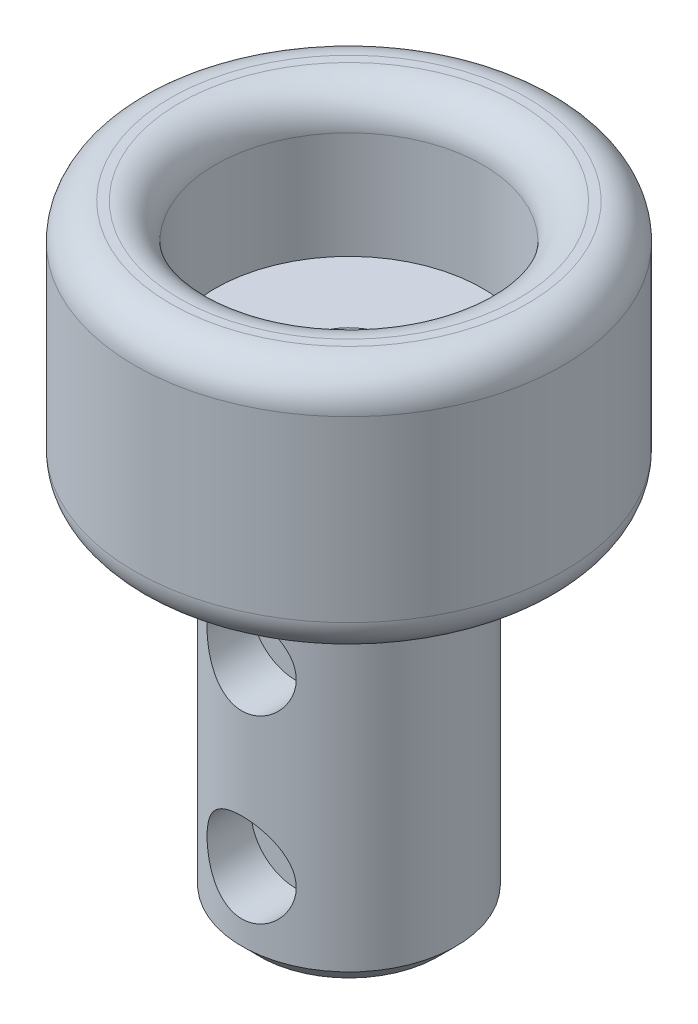
ISO-10303-21;
HEADER;
FILE_DESCRIPTION(('STEP AP214'),'2;1');
FILE_NAME('part.step','',(''),(''),'','','');
FILE_SCHEMA(('AUTOMOTIVE_DESIGN { 1 0 10303 214 1 1 1 1 }'));
ENDSEC;
DATA;
#1=APPLICATION_CONTEXT('core data for automotive mechanical design processes');
#2=APPLICATION_PROTOCOL_DEFINITION('international standard','automotive_design',2000,#1);
#3=PRODUCT_CONTEXT('',#1,'mechanical');
#4=PRODUCT('Part','Part','',(#3));
#5=PRODUCT_RELATED_PRODUCT_CATEGORY('part','',(#4));
#6=PRODUCT_DEFINITION_FORMATION('','',#4);
#7=PRODUCT_DEFINITION_CONTEXT('part definition',#1,'design');
#8=PRODUCT_DEFINITION('design','',#6,#7);
#9=PRODUCT_DEFINITION_SHAPE('','',#8);
#10=(LENGTH_UNIT() NAMED_UNIT(*) SI_UNIT(.MILLI.,.METRE.));
#11=(NAMED_UNIT(*) PLANE_ANGLE_UNIT() SI_UNIT($,.RADIAN.));
#12=(NAMED_UNIT(*) SI_UNIT($,.STERADIAN.) SOLID_ANGLE_UNIT());
#13=UNCERTAINTY_MEASURE_WITH_UNIT(LENGTH_MEASURE(1.E-05),#10,'distance_accuracy_value','');
#14=(GEOMETRIC_REPRESENTATION_CONTEXT(3) GLOBAL_UNCERTAINTY_ASSIGNED_CONTEXT((#13)) GLOBAL_UNIT_ASSIGNED_CONTEXT((#10,
#11,#12)) REPRESENTATION_CONTEXT('',''));
#15=CARTESIAN_POINT('',(0.,0.,0.));
#16=DIRECTION('',(0.,0.,1.));
#17=DIRECTION('',(1.,0.,0.));
#18=AXIS2_PLACEMENT_3D('',#15,#16,#17);
#19=CARTESIAN_POINT('',(0.,-10.1,0.));
#20=DIRECTION('',(0.,1.,0.));
#21=DIRECTION('',(0.,0.,1.));
#22=AXIS2_PLACEMENT_3D('',#19,#20,#21);
#23=CYLINDRICAL_SURFACE('',#22,3.);
#24=CARTESIAN_POINT('',(0.,-0.6,0.));
#25=DIRECTION('',(0.,-1.,0.));
#26=DIRECTION('',(0.,0.,-1.));
#27=AXIS2_PLACEMENT_3D('',#24,#25,#26);
#28=CIRCLE('',#27,3.);
#29=CARTESIAN_POINT('',(0.,-0.6,-3.));
#30=VERTEX_POINT('',#29);
#31=EDGE_CURVE('E53',#30,#30,#28,.T.);
#32=ORIENTED_EDGE('',*,*,#31,.T.);
#33=EDGE_LOOP('',(#32));
#34=FACE_BOUND('',#33,.T.);
#35=CARTESIAN_POINT('',(0.,-9.6,0.));
#36=DIRECTION('',(0.,-1.,0.));
#37=DIRECTION('',(0.,0.,-1.));
#38=AXIS2_PLACEMENT_3D('',#35,#36,#37);
#39=CIRCLE('',#38,3.);
#40=CARTESIAN_POINT('',(0.,-9.6,-3.));
#41=VERTEX_POINT('',#40);
#42=EDGE_CURVE('E57',#41,#41,#39,.F.);
#43=ORIENTED_EDGE('',*,*,#42,.T.);
#44=EDGE_LOOP('',(#43));
#45=FACE_BOUND('',#44,.T.);
#46=CARTESIAN_POINT('',(0.,-3.88538633236561,3.));
#47=CARTESIAN_POINT('',(0.066958052636267,-3.88537912727431,2.99999458367273));
#48=CARTESIAN_POINT('',(0.134021397063841,-3.87997437383747,2.9977323297471));
#49=CARTESIAN_POINT('',(0.266247371156347,-3.85854726744543,2.98890153579552));
#50=CARTESIAN_POINT('',(0.331404576423565,-3.84249720790136,2.98232175901028));
#51=CARTESIAN_POINT('',(0.457688733653088,-3.80047524058502,2.96556289038127));
#52=CARTESIAN_POINT('',(0.518828524426269,-3.77453694289746,2.95539599975004));
#53=CARTESIAN_POINT('',(0.635829756679803,-3.71361350913304,2.93245286470664));
#54=CARTESIAN_POINT('',(0.69169279001594,-3.67863111339474,2.91967741092849));
#55=CARTESIAN_POINT('',(0.799448403559513,-3.59875734977473,2.89207828351869));
#56=CARTESIAN_POINT('',(0.85104126751777,-3.55348502357586,2.87718753326093));
#57=CARTESIAN_POINT('',(0.946159821091264,-3.45512199758304,2.84732714068514));
#58=CARTESIAN_POINT('',(0.989681263153087,-3.4020272074711,2.83235746106809));
#59=CARTESIAN_POINT('',(1.06953737697066,-3.28635955480071,2.80321021812995));
#60=CARTESIAN_POINT('',(1.10541308153925,-3.22344888393906,2.78910786873385));
#61=CARTESIAN_POINT('',(1.16593940588866,-3.09181307444468,2.76435572357005));
#62=CARTESIAN_POINT('',(1.19059580836291,-3.02309095288116,2.75370415000823));
#63=CARTESIAN_POINT('',(1.22674598312159,-2.88523264059769,2.73778555387705));
#64=CARTESIAN_POINT('',(1.23881657877606,-2.81627584897345,2.73228387651787));
#65=CARTESIAN_POINT('',(1.25125209967796,-2.67711303967904,2.72661326219504));
#66=CARTESIAN_POINT('',(1.25162348054397,-2.60690773233987,2.7264413842526));
#67=CARTESIAN_POINT('',(1.24108450363674,-2.47298627193067,2.73125119560853));
#68=CARTESIAN_POINT('',(1.23103681112301,-2.40918523580115,2.73583882723623));
#69=CARTESIAN_POINT('',(1.20139191015777,-2.28427424136522,2.74898482773796));
#70=CARTESIAN_POINT('',(1.18179287287177,-2.22316480087383,2.75754395703564));
#71=CARTESIAN_POINT('',(1.13321958727571,-2.10382862937416,2.77786184772756));
#72=CARTESIAN_POINT('',(1.10405471539236,-2.04569091145223,2.78968481949136));
#73=CARTESIAN_POINT('',(1.03731242580562,-1.93490859848546,2.81518331141086));
#74=CARTESIAN_POINT('',(0.999731690519546,-1.88226618175209,2.82885956129779));
#75=CARTESIAN_POINT('',(0.913495965543837,-1.77928637363277,2.85792976877979));
#76=CARTESIAN_POINT('',(0.864173483207528,-1.72951976498017,2.87337121404473));
#77=CARTESIAN_POINT('',(0.757729591051514,-1.63877282940642,2.90325673112529));
#78=CARTESIAN_POINT('',(0.700606359448458,-1.59779456067343,2.9177005687701));
#79=CARTESIAN_POINT('',(0.578447948693378,-1.52495050874934,2.94438283556473));
#80=CARTESIAN_POINT('',(0.513260582447682,-1.49331688721492,2.95656266543334));
#81=CARTESIAN_POINT('',(0.377852402526833,-1.44166519276235,2.97689481414803));
#82=CARTESIAN_POINT('',(0.307634394795036,-1.42164070042179,2.985049358458));
#83=CARTESIAN_POINT('',(0.168928113346229,-1.39497034023897,2.99599641186385));
#84=CARTESIAN_POINT('',(0.10061128527864,-1.38755847492186,2.99909541047125));
#85=CARTESIAN_POINT('',(-0.0363546554960888,-1.38404010875151,3.00056050368745));
#86=CARTESIAN_POINT('',(-0.105003667152635,-1.38793036211361,2.99892795711939));
#87=CARTESIAN_POINT('',(-0.237098242341435,-1.40635741717167,2.9913121765694));
#88=CARTESIAN_POINT('',(-0.300632966639386,-1.4203562864628,2.9855488728399));
#89=CARTESIAN_POINT('',(-0.424382748971091,-1.45785452690639,2.97048606772414));
#90=CARTESIAN_POINT('',(-0.484597386518361,-1.48135509831591,2.96118611959704));
#91=CARTESIAN_POINT('',(-0.602108999869136,-1.53795730807772,2.93958270645166));
#92=CARTESIAN_POINT('',(-0.659257236855324,-1.57133451551164,2.92719491469281));
#93=CARTESIAN_POINT('',(-0.767346216231429,-1.6464397101573,2.9007380457909));
#94=CARTESIAN_POINT('',(-0.818284352601941,-1.68817118389488,2.88666826768733));
#95=CARTESIAN_POINT('',(-0.916333430274264,-1.78228956563801,2.85712087895438));
#96=CARTESIAN_POINT('',(-0.962910697979836,-1.83522483535187,2.84161451591029));
#97=CARTESIAN_POINT('',(-1.04666984610551,-1.948407608301,2.81184336768005));
#98=CARTESIAN_POINT('',(-1.08384959285617,-2.00865676753734,2.79757886493438));
#99=CARTESIAN_POINT('',(-1.14815960208699,-2.13600050766818,2.77181386243988));
#100=CARTESIAN_POINT('',(-1.17513918237329,-2.20318036788044,2.76035562555112));
#101=CARTESIAN_POINT('',(-1.21717413951573,-2.34175692617571,2.74208355658957));
#102=CARTESIAN_POINT('',(-1.23223934863688,-2.41315009484895,2.73526589555752));
#103=CARTESIAN_POINT('',(-1.24904080348901,-2.55220503156482,2.72763164537264));
#104=CARTESIAN_POINT('',(-1.25171380413129,-2.61973099465822,2.72639350967163));
#105=CARTESIAN_POINT('',(-1.24615575523912,-2.75422919350671,2.72893853011024));
#106=CARTESIAN_POINT('',(-1.23792637964722,-2.8212015126793,2.73272091540306));
#107=CARTESIAN_POINT('',(-1.21158404780491,-2.9494790798345,2.74449551302268));
#108=CARTESIAN_POINT('',(-1.19394903571466,-3.010903005829,2.7522835484648));
#109=CARTESIAN_POINT('',(-1.14976328202135,-3.12993435372283,2.77103181199189));
#110=CARTESIAN_POINT('',(-1.12321003517252,-3.18754069776439,2.78199293131693));
#111=CARTESIAN_POINT('',(-1.0601028593549,-3.30108222831473,2.80666954560013));
#112=CARTESIAN_POINT('',(-1.02304360910483,-3.3567086625339,2.82051102713679));
#113=CARTESIAN_POINT('',(-0.940684072630393,-3.46124647172629,2.84903689053839));
#114=CARTESIAN_POINT('',(-0.895380928905621,-3.51015550796618,2.86372156345875));
#115=CARTESIAN_POINT('',(-0.793902045778823,-3.60353501405035,2.89356392850106));
#116=CARTESIAN_POINT('',(-0.73717473994903,-3.64742276520626,2.90867817511792));
#117=CARTESIAN_POINT('',(-0.616600079253201,-3.72508578590923,2.9366014362202));
#118=CARTESIAN_POINT('',(-0.552749497945747,-3.75885644725516,2.9494093991674));
#119=CARTESIAN_POINT('',(-0.420732056717951,-3.81459617780549,2.97109183362461));
#120=CARTESIAN_POINT('',(-0.352653990980637,-3.83675109898291,2.98002782581964));
#121=CARTESIAN_POINT('',(-0.213410421846559,-3.86909266144344,2.99321009768625));
#122=CARTESIAN_POINT('',(-0.142255316980958,-3.87931677489549,2.99747105811967));
#123=CARTESIAN_POINT('',(-0.0472360819191837,-3.88471949345206,2.99972287568934));
#124=CARTESIAN_POINT('',(-0.0236245946756573,-3.88538887451483,3.00000191102536));
#125=CARTESIAN_POINT('',(0.,-3.88538633236561,3.));
#126=B_SPLINE_CURVE_WITH_KNOTS('',3,(#46,#47,#48,#49,#50,#51,#52,#53,#54,#55,#56,#57,#58,#59,
#60,#61,#62,#63,#64,#65,#66,#67,#68,#69,#70,#71,#72,#73,#74,#75,#76,#77,#78,#79,#80,#81,#82,#83,
#84,#85,#86,#87,#88,#89,#90,#91,#92,#93,#94,#95,#96,#97,#98,#99,#100,#101,#102,#103,#104,#105,
#106,#107,#108,#109,#110,#111,#112,#113,#114,#115,#116,#117,#118,#119,#120,#121,#122,#123,#124,
#125),.UNSPECIFIED.,.T.,.F.,(4,2,2,2,2,2,2,2,2,2,2,2,2,2,2,2,2,2,2,2,2,2,2,2,2,2,2,2,2,2,2,2,2,
2,2,2,2,2,2,4),(0.,0.200806918883939,0.402138540628697,0.602791851906302,0.803384436852976,
1.01317936288807,1.22308438131466,1.44331724539125,1.66343646730588,1.87295273137558,
2.08235338249046,2.27570157202557,2.46908679727213,2.66658713058715,2.86416545717207,
3.07844141127897,3.29276749314588,3.51204055060814,3.73119224218297,3.93648443393251,
4.14171767493172,4.33676589735722,4.53183876601785,4.73297135272161,4.93418805469496,
5.14978488029295,5.36543061240342,5.58414788359524,5.80268447074581,6.00439877559644,
6.20608211297537,6.39837649964763,6.59072494950613,6.79463893397442,6.99862373425945,
7.2174653500489,7.43640649428583,7.65172855819386,7.86637250469322,7.93722256499099),.UNSPECIFIED.);
#127=CARTESIAN_POINT('',(0.,-3.88538633236561,3.));
#128=VERTEX_POINT('',#127);
#129=EDGE_CURVE('E72',#128,#128,#126,.T.);
#130=ORIENTED_EDGE('',*,*,#129,.F.);
#131=EDGE_LOOP('',(#130));
#132=FACE_BOUND('',#131,.T.);
#133=CARTESIAN_POINT('',(0.,-8.93473810902221,3.));
#134=CARTESIAN_POINT('',(0.0669580526362668,-8.93473090393091,2.99999458367273));
#135=CARTESIAN_POINT('',(0.134021397063841,-8.92932615049408,2.9977323297471));
#136=CARTESIAN_POINT('',(0.266247371156347,-8.90789904410203,2.98890153579552));
#137=CARTESIAN_POINT('',(0.331404576423565,-8.89184898455796,2.98232175901028));
#138=CARTESIAN_POINT('',(0.457688733653088,-8.84982701724162,2.96556289038127));
#139=CARTESIAN_POINT('',(0.518828524426268,-8.82388871955406,2.95539599975004));
#140=CARTESIAN_POINT('',(0.635829756679802,-8.76296528578964,2.93245286470664));
#141=CARTESIAN_POINT('',(0.69169279001594,-8.72798289005135,2.91967741092849));
#142=CARTESIAN_POINT('',(0.799448403559512,-8.64810912643133,2.89207828351869));
#143=CARTESIAN_POINT('',(0.851041267517769,-8.60283680023246,2.87718753326093));
#144=CARTESIAN_POINT('',(0.946159821091263,-8.50447377423964,2.84732714068513));
#145=CARTESIAN_POINT('',(0.989681263153086,-8.45137898412771,2.83235746106809));
#146=CARTESIAN_POINT('',(1.06953737697066,-8.33571133145732,2.80321021812995));
#147=CARTESIAN_POINT('',(1.10541308153925,-8.27280066059567,2.78910786873385));
#148=CARTESIAN_POINT('',(1.16593940588866,-8.14116485110128,2.76435572357005));
#149=CARTESIAN_POINT('',(1.19059580836291,-8.07244272953776,2.75370415000823));
#150=CARTESIAN_POINT('',(1.22674598312159,-7.93458441725429,2.73778555387705));
#151=CARTESIAN_POINT('',(1.23881657877606,-7.86562762563006,2.73228387651787));
#152=CARTESIAN_POINT('',(1.25125209967796,-7.72646481633564,2.72661326219504));
#153=CARTESIAN_POINT('',(1.25162348054397,-7.65625950899647,2.7264413842526));
#154=CARTESIAN_POINT('',(1.24108450363674,-7.52233804858727,2.73125119560853));
#155=CARTESIAN_POINT('',(1.23103681112301,-7.45853701245775,2.73583882723623));
#156=CARTESIAN_POINT('',(1.20139191015777,-7.33362601802182,2.74898482773796));
#157=CARTESIAN_POINT('',(1.18179287287177,-7.27251657753044,2.75754395703564));
#158=CARTESIAN_POINT('',(1.13321958727571,-7.15318040603077,2.77786184772756));
#159=CARTESIAN_POINT('',(1.10405471539236,-7.09504268810883,2.78968481949136));
#160=CARTESIAN_POINT('',(1.03731242580562,-6.98426037514206,2.81518331141086));
#161=CARTESIAN_POINT('',(0.999731690519545,-6.93161795840869,2.82885956129779));
#162=CARTESIAN_POINT('',(0.913495965543837,-6.82863815028937,2.85792976877979));
#163=CARTESIAN_POINT('',(0.864173483207527,-6.77887154163677,2.87337121404473));
#164=CARTESIAN_POINT('',(0.757729591051513,-6.68812460606303,2.90325673112529));
#165=CARTESIAN_POINT('',(0.700606359448457,-6.64714633733003,2.9177005687701));
#166=CARTESIAN_POINT('',(0.578447948693377,-6.57430228540594,2.94438283556473));
#167=CARTESIAN_POINT('',(0.513260582447681,-6.54266866387153,2.95656266543334));
#168=CARTESIAN_POINT('',(0.377852402526832,-6.49101696941895,2.97689481414803));
#169=CARTESIAN_POINT('',(0.307634394795036,-6.47099247707839,2.985049358458));
#170=CARTESIAN_POINT('',(0.168928113346228,-6.44432211689557,2.99599641186385));
#171=CARTESIAN_POINT('',(0.100611285278639,-6.43691025157846,2.99909541047125));
#172=CARTESIAN_POINT('',(-0.036354655496089,-6.43339188540812,3.00056050368745));
#173=CARTESIAN_POINT('',(-0.105003667152635,-6.43728213877021,2.99892795711939));
#174=CARTESIAN_POINT('',(-0.237098242341435,-6.45570919382828,2.9913121765694));
#175=CARTESIAN_POINT('',(-0.300632966639386,-6.46970806311941,2.9855488728399));
#176=CARTESIAN_POINT('',(-0.424382748971091,-6.50720630356299,2.97048606772414));
#177=CARTESIAN_POINT('',(-0.484597386518361,-6.53070687497251,2.96118611959704));
#178=CARTESIAN_POINT('',(-0.602108999869137,-6.58730908473433,2.93958270645166));
#179=CARTESIAN_POINT('',(-0.659257236855324,-6.62068629216824,2.92719491469281));
#180=CARTESIAN_POINT('',(-0.76734621623143,-6.69579148681391,2.9007380457909));
#181=CARTESIAN_POINT('',(-0.818284352601942,-6.73752296055148,2.88666826768733));
#182=CARTESIAN_POINT('',(-0.916333430274265,-6.83164134229462,2.85712087895438));
#183=CARTESIAN_POINT('',(-0.962910697979836,-6.88457661200847,2.84161451591029));
#184=CARTESIAN_POINT('',(-1.04666984610551,-6.9977593849576,2.81184336768005));
#185=CARTESIAN_POINT('',(-1.08384959285617,-7.05800854419394,2.79757886493438));
#186=CARTESIAN_POINT('',(-1.14815960208699,-7.18535228432479,2.77181386243988));
#187=CARTESIAN_POINT('',(-1.17513918237329,-7.25253214453704,2.76035562555112));
#188=CARTESIAN_POINT('',(-1.21717413951573,-7.39110870283232,2.74208355658957));
#189=CARTESIAN_POINT('',(-1.23223934863688,-7.46250187150556,2.73526589555752));
#190=CARTESIAN_POINT('',(-1.24904080348901,-7.60155680822142,2.72763164537264));
#191=CARTESIAN_POINT('',(-1.25171380413129,-7.66908277131483,2.72639350967163));
#192=CARTESIAN_POINT('',(-1.24615575523912,-7.80358097016331,2.72893853011024));
#193=CARTESIAN_POINT('',(-1.23792637964722,-7.8705532893359,2.73272091540306));
#194=CARTESIAN_POINT('',(-1.21158404780491,-7.9988308564911,2.74449551302268));
#195=CARTESIAN_POINT('',(-1.19394903571466,-8.0602547824856,2.7522835484648));
#196=CARTESIAN_POINT('',(-1.14976328202135,-8.17928613037944,2.77103181199189));
#197=CARTESIAN_POINT('',(-1.12321003517252,-8.23689247442099,2.78199293131693));
#198=CARTESIAN_POINT('',(-1.0601028593549,-8.35043400497133,2.80666954560013));
#199=CARTESIAN_POINT('',(-1.02304360910483,-8.4060604391905,2.82051102713679));
#200=CARTESIAN_POINT('',(-0.940684072630392,-8.51059824838289,2.84903689053839));
#201=CARTESIAN_POINT('',(-0.89538092890562,-8.55950728462278,2.86372156345875));
#202=CARTESIAN_POINT('',(-0.793902045778822,-8.65288679070695,2.89356392850106));
#203=CARTESIAN_POINT('',(-0.737174739949028,-8.69677454186286,2.90867817511791));
#204=CARTESIAN_POINT('',(-0.616600079253199,-8.77443756256584,2.9366014362202));
#205=CARTESIAN_POINT('',(-0.552749497945746,-8.80820822391177,2.9494093991674));
#206=CARTESIAN_POINT('',(-0.420732056717951,-8.8639479544621,2.97109183362461));
#207=CARTESIAN_POINT('',(-0.352653990980636,-8.88610287563951,2.98002782581964));
#208=CARTESIAN_POINT('',(-0.213410421846558,-8.91844443810005,2.99321009768625));
#209=CARTESIAN_POINT('',(-0.142255316980958,-8.9286685515521,2.99747105811967));
#210=CARTESIAN_POINT('',(-0.0472360819191835,-8.93407127010866,2.99972287568934));
#211=CARTESIAN_POINT('',(-0.0236245946756572,-8.93474065117144,3.00000191102536));
#212=CARTESIAN_POINT('',(0.,-8.93473810902221,3.));
#213=B_SPLINE_CURVE_WITH_KNOTS('',3,(#133,#134,#135,#136,#137,#138,#139,#140,#141,#142,#143,
#144,#145,#146,#147,#148,#149,#150,#151,#152,#153,#154,#155,#156,#157,#158,#159,#160,#161,#162,
#163,#164,#165,#166,#167,#168,#169,#170,#171,#172,#173,#174,#175,#176,#177,#178,#179,#180,#181,
#182,#183,#184,#185,#186,#187,#188,#189,#190,#191,#192,#193,#194,#195,#196,#197,#198,#199,#200,
#201,#202,#203,#204,#205,#206,#207,#208,#209,#210,#211,#212),.UNSPECIFIED.,.T.,.F.,(4,2,2,2,2,2,
2,2,2,2,2,2,2,2,2,2,2,2,2,2,2,2,2,2,2,2,2,2,2,2,2,2,2,2,2,2,2,2,2,4),(0.,0.200806918883939,
0.402138540628697,0.602791851906301,0.803384436852974,1.01317936288807,1.22308438131465,
1.44331724539125,1.66343646730588,1.87295273137558,2.08235338249046,2.27570157202557,
2.46908679727213,2.66658713058715,2.86416545717207,3.07844141127897,3.29276749314588,
3.51204055060814,3.73119224218297,3.93648443393251,4.14171767493172,4.33676589735722,
4.53183876601785,4.73297135272161,4.93418805469496,5.14978488029295,5.36543061240342,
5.58414788359524,5.80268447074581,6.00439877559644,6.20608211297537,6.39837649964763,
6.59072494950613,6.79463893397442,6.99862373425944,7.2174653500489,7.43640649428583,
7.65172855819386,7.86637250469322,7.93722256499099),.UNSPECIFIED.);
#214=CARTESIAN_POINT('',(0.,-8.93473810902221,3.));
#215=VERTEX_POINT('',#214);
#216=EDGE_CURVE('E63',#215,#215,#213,.T.);
#217=ORIENTED_EDGE('',*,*,#216,.F.);
#218=EDGE_LOOP('',(#217));
#219=FACE_BOUND('',#218,.T.);
#220=ADVANCED_FACE('F42',(#34,#45,#132,#219),#23,.T.);
#221=CARTESIAN_POINT('',(0.,-10.1,0.));
#222=DIRECTION('',(0.,-1.,0.));
#223=DIRECTION('',(0.,0.,-1.));
#224=AXIS2_PLACEMENT_3D('',#221,#222,#223);
#225=PLANE('',#224);
#226=CARTESIAN_POINT('',(0.,-10.1,0.));
#227=DIRECTION('',(0.,-1.,0.));
#228=DIRECTION('',(0.,0.,-1.));
#229=AXIS2_PLACEMENT_3D('',#226,#227,#228);
#230=CIRCLE('',#229,2.5);
#231=CARTESIAN_POINT('',(0.,-10.1,-2.5));
#232=VERTEX_POINT('',#231);
#233=EDGE_CURVE('E11',#232,#232,#230,.T.);
#234=ORIENTED_EDGE('',*,*,#233,.T.);
#235=EDGE_LOOP('',(#234));
#236=FACE_BOUND('',#235,.T.);
#237=CARTESIAN_POINT('',(0.,-10.1,0.));
#238=DIRECTION('',(0.,-1.,0.));
#239=DIRECTION('',(0.,0.,-1.));
#240=AXIS2_PLACEMENT_3D('',#237,#238,#239);
#241=CIRCLE('',#240,1.);
#242=CARTESIAN_POINT('',(0.,-10.1,-1.));
#243=VERTEX_POINT('',#242);
#244=EDGE_CURVE('E62',#243,#243,#241,.T.);
#245=ORIENTED_EDGE('',*,*,#244,.F.);
#246=EDGE_LOOP('',(#245));
#247=FACE_BOUND('',#246,.T.);
#248=ADVANCED_FACE('F99',(#236,#247),#225,.T.);
#249=CARTESIAN_POINT('',(0.,-0.1,0.));
#250=DIRECTION('',(0.,-1.,0.));
#251=DIRECTION('',(0.,0.,-1.));
#252=AXIS2_PLACEMENT_3D('',#249,#250,#251);
#253=PLANE('',#252);
#254=CARTESIAN_POINT('',(0.,-0.1,0.));
#255=DIRECTION('',(0.,-1.,0.));
#256=DIRECTION('',(0.,0.,-1.));
#257=AXIS2_PLACEMENT_3D('',#254,#255,#256);
#258=CIRCLE('',#257,2.5);
#259=CARTESIAN_POINT('',(0.,-0.1,-2.5));
#260=VERTEX_POINT('',#259);
#261=EDGE_CURVE('E49',#260,#260,#258,.F.);
#262=ORIENTED_EDGE('',*,*,#261,.T.);
#263=EDGE_LOOP('',(#262));
#264=FACE_BOUND('',#263,.T.);
#265=CARTESIAN_POINT('',(0.,-0.1,0.));
#266=DIRECTION('',(0.,-1.,0.));
#267=DIRECTION('',(0.,0.,-1.));
#268=AXIS2_PLACEMENT_3D('',#265,#266,#267);
#269=CIRCLE('',#268,1.);
#270=CARTESIAN_POINT('',(0.,-0.1,-1.));
#271=VERTEX_POINT('',#270);
#272=EDGE_CURVE('E119',#271,#271,#269,.T.);
#273=ORIENTED_EDGE('',*,*,#272,.T.);
#274=EDGE_LOOP('',(#273));
#275=FACE_BOUND('',#274,.T.);
#276=ADVANCED_FACE('F97',(#264,#275),#253,.F.);
#277=CARTESIAN_POINT('',(0.,-10.1,0.));
#278=DIRECTION('',(0.,1.,0.));
#279=DIRECTION('',(0.,0.,1.));
#280=AXIS2_PLACEMENT_3D('',#277,#278,#279);
#281=CYLINDRICAL_SURFACE('',#280,1.);
#282=ORIENTED_EDGE('',*,*,#244,.T.);
#283=EDGE_LOOP('',(#282));
#284=FACE_BOUND('',#283,.T.);
#285=ORIENTED_EDGE('',*,*,#272,.F.);
#286=EDGE_LOOP('',(#285));
#287=FACE_BOUND('',#286,.T.);
#288=ADVANCED_FACE('F93',(#284,#287),#281,.F.);
#289=CARTESIAN_POINT('',(0.,-2.63538633236561,11.5));
#290=DIRECTION('',(0.,0.,-1.));
#291=DIRECTION('',(-1.,0.,0.));
#292=AXIS2_PLACEMENT_3D('',#289,#290,#291);
#293=CYLINDRICAL_SURFACE('',#292,1.25);
#294=CARTESIAN_POINT('',(0.,-2.63538633236561,1.5));
#295=DIRECTION('',(0.,0.,1.));
#296=DIRECTION('',(1.,0.,0.));
#297=AXIS2_PLACEMENT_3D('',#294,#295,#296);
#298=CIRCLE('',#297,1.25);
#299=CARTESIAN_POINT('',(1.25,-2.63538633236561,1.5));
#300=VERTEX_POINT('',#299);
#301=EDGE_CURVE('E70',#300,#300,#298,.T.);
#302=ORIENTED_EDGE('',*,*,#301,.F.);
#303=EDGE_LOOP('',(#302));
#304=FACE_BOUND('',#303,.T.);
#305=ORIENTED_EDGE('',*,*,#129,.T.);
#306=EDGE_LOOP('',(#305));
#307=FACE_BOUND('',#306,.T.);
#308=ADVANCED_FACE('F88',(#304,#307),#293,.F.);
#309=CARTESIAN_POINT('',(0.,-2.63538633236561,1.5));
#310=DIRECTION('',(0.,0.,1.));
#311=DIRECTION('',(1.,0.,0.));
#312=AXIS2_PLACEMENT_3D('',#309,#310,#311);
#313=PLANE('',#312);
#314=ORIENTED_EDGE('',*,*,#301,.T.);
#315=EDGE_LOOP('',(#314));
#316=FACE_BOUND('',#315,.T.);
#317=ADVANCED_FACE('F85',(#316),#313,.T.);
#318=CARTESIAN_POINT('',(0.,-7.68473810902221,11.5));
#319=DIRECTION('',(0.,0.,-1.));
#320=DIRECTION('',(-1.,0.,0.));
#321=AXIS2_PLACEMENT_3D('',#318,#319,#320);
#322=CYLINDRICAL_SURFACE('',#321,1.25);
#323=CARTESIAN_POINT('',(0.,-7.68473810902221,1.5));
#324=DIRECTION('',(0.,0.,1.));
#325=DIRECTION('',(1.,0.,0.));
#326=AXIS2_PLACEMENT_3D('',#323,#324,#325);
#327=CIRCLE('',#326,1.25);
#328=CARTESIAN_POINT('',(1.25,-7.68473810902221,1.5));
#329=VERTEX_POINT('',#328);
#330=EDGE_CURVE('E71',#329,#329,#327,.T.);
#331=ORIENTED_EDGE('',*,*,#330,.F.);
#332=EDGE_LOOP('',(#331));
#333=FACE_BOUND('',#332,.T.);
#334=ORIENTED_EDGE('',*,*,#216,.T.);
#335=EDGE_LOOP('',(#334));
#336=FACE_BOUND('',#335,.T.);
#337=ADVANCED_FACE('F79',(#333,#336),#322,.F.);
#338=CARTESIAN_POINT('',(0.,-7.68473810902221,1.5));
#339=DIRECTION('',(0.,0.,1.));
#340=DIRECTION('',(1.,0.,0.));
#341=AXIS2_PLACEMENT_3D('',#338,#339,#340);
#342=PLANE('',#341);
#343=ORIENTED_EDGE('',*,*,#330,.T.);
#344=EDGE_LOOP('',(#343));
#345=FACE_BOUND('',#344,.T.);
#346=ADVANCED_FACE('F84',(#345),#342,.T.);
#347=CARTESIAN_POINT('',(0.,-0.6,0.));
#348=DIRECTION('',(0.,-1.,0.));
#349=DIRECTION('',(0.,0.,-1.));
#350=AXIS2_PLACEMENT_3D('',#347,#348,#349);
#351=CONICAL_SURFACE('',#350,3.,0.785398163397449);
#352=ORIENTED_EDGE('',*,*,#261,.F.);
#353=EDGE_LOOP('',(#352));
#354=FACE_BOUND('',#353,.T.);
#355=ORIENTED_EDGE('',*,*,#31,.F.);
#356=EDGE_LOOP('',(#355));
#357=FACE_BOUND('',#356,.T.);
#358=ADVANCED_FACE('F135',(#354,#357),#351,.T.);
#359=CARTESIAN_POINT('',(0.,-10.1,0.));
#360=DIRECTION('',(0.,1.,0.));
#361=DIRECTION('',(0.,0.,1.));
#362=AXIS2_PLACEMENT_3D('',#359,#360,#361);
#363=CONICAL_SURFACE('',#362,2.5,0.785398163397448);
#364=ORIENTED_EDGE('',*,*,#42,.F.);
#365=EDGE_LOOP('',(#364));
#366=FACE_BOUND('',#365,.T.);
#367=ORIENTED_EDGE('',*,*,#233,.F.);
#368=EDGE_LOOP('',(#367));
#369=FACE_BOUND('',#368,.T.);
#370=ADVANCED_FACE('F44',(#366,#369),#363,.T.);
#371=CLOSED_SHELL('',(#220,#248,#276,#288,#308,#317,#337,#346,#358,#370));
#372=MANIFOLD_SOLID_BREP('B2',#371);
#373=CARTESIAN_POINT('',(0.,7.,0.));
#374=DIRECTION('',(0.,-1.,0.));
#375=DIRECTION('',(0.,0.,-1.));
#376=AXIS2_PLACEMENT_3D('',#373,#374,#375);
#377=CYLINDRICAL_SURFACE('',#376,6.);
#378=CARTESIAN_POINT('',(0.,6.,0.));
#379=DIRECTION('',(0.,1.,0.));
#380=DIRECTION('',(0.,0.,1.));
#381=AXIS2_PLACEMENT_3D('',#378,#379,#380);
#382=CIRCLE('',#381,6.);
#383=CARTESIAN_POINT('',(0.,6.,6.));
#384=VERTEX_POINT('',#383);
#385=EDGE_CURVE('E224',#384,#384,#382,.F.);
#386=ORIENTED_EDGE('',*,*,#385,.T.);
#387=EDGE_LOOP('',(#386));
#388=FACE_BOUND('',#387,.T.);
#389=CARTESIAN_POINT('',(0.,1.,0.));
#390=DIRECTION('',(0.,1.,0.));
#391=DIRECTION('',(0.,0.,1.));
#392=AXIS2_PLACEMENT_3D('',#389,#390,#391);
#393=CIRCLE('',#392,6.);
#394=CARTESIAN_POINT('',(0.,1.,6.));
#395=VERTEX_POINT('',#394);
#396=EDGE_CURVE('E227',#395,#395,#393,.T.);
#397=ORIENTED_EDGE('',*,*,#396,.T.);
#398=EDGE_LOOP('',(#397));
#399=FACE_BOUND('',#398,.T.);
#400=ADVANCED_FACE('F201',(#388,#399),#377,.T.);
#401=CARTESIAN_POINT('',(0.,7.,0.));
#402=DIRECTION('',(0.,1.,0.));
#403=DIRECTION('',(0.,0.,1.));
#404=AXIS2_PLACEMENT_3D('',#401,#402,#403);
#405=PLANE('',#404);
#406=CARTESIAN_POINT('',(0.,7.,0.));
#407=DIRECTION('',(0.,1.,0.));
#408=DIRECTION('',(0.,0.,1.));
#409=AXIS2_PLACEMENT_3D('',#406,#407,#408);
#410=CIRCLE('',#409,4.75);
#411=CARTESIAN_POINT('',(0.,7.,4.75));
#412=VERTEX_POINT('',#411);
#413=EDGE_CURVE('E230',#412,#412,#410,.F.);
#414=ORIENTED_EDGE('',*,*,#413,.T.);
#415=EDGE_LOOP('',(#414));
#416=FACE_BOUND('',#415,.T.);
#417=CARTESIAN_POINT('',(0.,7.,0.));
#418=DIRECTION('',(0.,1.,0.));
#419=DIRECTION('',(0.,0.,1.));
#420=AXIS2_PLACEMENT_3D('',#417,#418,#419);
#421=CIRCLE('',#420,5.);
#422=CARTESIAN_POINT('',(0.,7.,5.));
#423=VERTEX_POINT('',#422);
#424=EDGE_CURVE('E233',#423,#423,#421,.T.);
#425=ORIENTED_EDGE('',*,*,#424,.T.);
#426=EDGE_LOOP('',(#425));
#427=FACE_BOUND('',#426,.T.);
#428=ADVANCED_FACE('F256',(#416,#427),#405,.T.);
#429=CARTESIAN_POINT('',(0.,0.,0.));
#430=DIRECTION('',(0.,1.,0.));
#431=DIRECTION('',(0.,0.,1.));
#432=AXIS2_PLACEMENT_3D('',#429,#430,#431);
#433=PLANE('',#432);
#434=CARTESIAN_POINT('',(0.,0.,0.));
#435=DIRECTION('',(0.,1.,0.));
#436=DIRECTION('',(0.,0.,1.));
#437=AXIS2_PLACEMENT_3D('',#434,#435,#436);
#438=CIRCLE('',#437,1.3);
#439=CARTESIAN_POINT('',(0.,0.,1.3));
#440=VERTEX_POINT('',#439);
#441=EDGE_CURVE('E41',#440,#440,#438,.T.);
#442=ORIENTED_EDGE('',*,*,#441,.T.);
#443=EDGE_LOOP('',(#442));
#444=FACE_BOUND('',#443,.T.);
#445=CARTESIAN_POINT('',(0.,0.,0.));
#446=DIRECTION('',(0.,1.,0.));
#447=DIRECTION('',(0.,0.,1.));
#448=AXIS2_PLACEMENT_3D('',#445,#446,#447);
#449=CIRCLE('',#448,5.);
#450=CARTESIAN_POINT('',(0.,0.,5.));
#451=VERTEX_POINT('',#450);
#452=EDGE_CURVE('E221',#451,#451,#449,.F.);
#453=ORIENTED_EDGE('',*,*,#452,.T.);
#454=EDGE_LOOP('',(#453));
#455=FACE_BOUND('',#454,.T.);
#456=ADVANCED_FACE('F247',(#444,#455),#433,.F.);
#457=CARTESIAN_POINT('',(0.,3.,0.));
#458=DIRECTION('',(0.,1.,0.));
#459=DIRECTION('',(0.,0.,1.));
#460=AXIS2_PLACEMENT_3D('',#457,#458,#459);
#461=CYLINDRICAL_SURFACE('',#460,3.75);
#462=CARTESIAN_POINT('',(0.,6.,0.));
#463=DIRECTION('',(0.,1.,0.));
#464=DIRECTION('',(0.,0.,1.));
#465=AXIS2_PLACEMENT_3D('',#462,#463,#464);
#466=CIRCLE('',#465,3.75);
#467=CARTESIAN_POINT('',(0.,6.,3.75));
#468=VERTEX_POINT('',#467);
#469=EDGE_CURVE('E236',#468,#468,#466,.T.);
#470=ORIENTED_EDGE('',*,*,#469,.T.);
#471=EDGE_LOOP('',(#470));
#472=FACE_BOUND('',#471,.T.);
#473=CARTESIAN_POINT('',(0.,3.,0.));
#474=DIRECTION('',(0.,1.,0.));
#475=DIRECTION('',(0.,0.,1.));
#476=AXIS2_PLACEMENT_3D('',#473,#474,#475);
#477=CIRCLE('',#476,3.75);
#478=CARTESIAN_POINT('',(0.,3.,3.75));
#479=VERTEX_POINT('',#478);
#480=EDGE_CURVE('E239',#479,#479,#477,.T.);
#481=ORIENTED_EDGE('',*,*,#480,.F.);
#482=EDGE_LOOP('',(#481));
#483=FACE_BOUND('',#482,.T.);
#484=ADVANCED_FACE('F245',(#472,#483),#461,.F.);
#485=CARTESIAN_POINT('',(0.,3.,0.));
#486=DIRECTION('',(0.,1.,0.));
#487=DIRECTION('',(0.,0.,1.));
#488=AXIS2_PLACEMENT_3D('',#485,#486,#487);
#489=PLANE('',#488);
#490=CARTESIAN_POINT('',(0.,3.,0.));
#491=DIRECTION('',(0.,1.,0.));
#492=DIRECTION('',(0.,0.,1.));
#493=AXIS2_PLACEMENT_3D('',#490,#491,#492);
#494=CIRCLE('',#493,1.3);
#495=CARTESIAN_POINT('',(0.,3.,1.3));
#496=VERTEX_POINT('',#495);
#497=EDGE_CURVE('E208',#496,#496,#494,.F.);
#498=ORIENTED_EDGE('',*,*,#497,.T.);
#499=EDGE_LOOP('',(#498));
#500=FACE_BOUND('',#499,.T.);
#501=ORIENTED_EDGE('',*,*,#480,.T.);
#502=EDGE_LOOP('',(#501));
#503=FACE_BOUND('',#502,.T.);
#504=ADVANCED_FACE('F243',(#500,#503),#489,.T.);
#505=CARTESIAN_POINT('',(0.,-1.,0.));
#506=DIRECTION('',(0.,1.,0.));
#507=DIRECTION('',(0.,0.,1.));
#508=AXIS2_PLACEMENT_3D('',#505,#506,#507);
#509=CYLINDRICAL_SURFACE('',#508,1.);
#510=CARTESIAN_POINT('',(0.,2.7,0.));
#511=DIRECTION('',(0.,1.,0.));
#512=DIRECTION('',(0.,0.,1.));
#513=AXIS2_PLACEMENT_3D('',#510,#511,#512);
#514=CIRCLE('',#513,1.);
#515=CARTESIAN_POINT('',(0.,2.7,1.));
#516=VERTEX_POINT('',#515);
#517=EDGE_CURVE('E212',#516,#516,#514,.T.);
#518=ORIENTED_EDGE('',*,*,#517,.T.);
#519=EDGE_LOOP('',(#518));
#520=FACE_BOUND('',#519,.T.);
#521=CARTESIAN_POINT('',(0.,0.299999999999997,0.));
#522=DIRECTION('',(0.,1.,0.));
#523=DIRECTION('',(0.,0.,1.));
#524=AXIS2_PLACEMENT_3D('',#521,#522,#523);
#525=CIRCLE('',#524,1.);
#526=CARTESIAN_POINT('',(0.,0.299999999999997,1.));
#527=VERTEX_POINT('',#526);
#528=EDGE_CURVE('E216',#527,#527,#525,.F.);
#529=ORIENTED_EDGE('',*,*,#528,.T.);
#530=EDGE_LOOP('',(#529));
#531=FACE_BOUND('',#530,.T.);
#532=ADVANCED_FACE('F254',(#520,#531),#509,.F.);
#533=CARTESIAN_POINT('',(0.,6.,0.));
#534=DIRECTION('',(0.,1.,0.));
#535=DIRECTION('',(0.,0.,1.));
#536=AXIS2_PLACEMENT_3D('',#533,#534,#535);
#537=TOROIDAL_SURFACE('',#536,4.75,1.);
#538=ORIENTED_EDGE('',*,*,#413,.F.);
#539=EDGE_LOOP('',(#538));
#540=FACE_BOUND('',#539,.T.);
#541=ORIENTED_EDGE('',*,*,#469,.F.);
#542=EDGE_LOOP('',(#541));
#543=FACE_BOUND('',#542,.T.);
#544=ADVANCED_FACE('F268',(#540,#543),#537,.T.);
#545=CARTESIAN_POINT('',(0.,6.,0.));
#546=DIRECTION('',(0.,1.,0.));
#547=DIRECTION('',(0.,0.,1.));
#548=AXIS2_PLACEMENT_3D('',#545,#546,#547);
#549=TOROIDAL_SURFACE('',#548,5.,1.);
#550=ORIENTED_EDGE('',*,*,#385,.F.);
#551=EDGE_LOOP('',(#550));
#552=FACE_BOUND('',#551,.T.);
#553=ORIENTED_EDGE('',*,*,#424,.F.);
#554=EDGE_LOOP('',(#553));
#555=FACE_BOUND('',#554,.T.);
#556=ADVANCED_FACE('F271',(#552,#555),#549,.T.);
#557=CARTESIAN_POINT('',(0.,1.,0.));
#558=DIRECTION('',(0.,1.,0.));
#559=DIRECTION('',(0.,0.,1.));
#560=AXIS2_PLACEMENT_3D('',#557,#558,#559);
#561=TOROIDAL_SURFACE('',#560,5.,1.);
#562=ORIENTED_EDGE('',*,*,#452,.F.);
#563=EDGE_LOOP('',(#562));
#564=FACE_BOUND('',#563,.T.);
#565=ORIENTED_EDGE('',*,*,#396,.F.);
#566=EDGE_LOOP('',(#565));
#567=FACE_BOUND('',#566,.T.);
#568=ADVANCED_FACE('F275',(#564,#567),#561,.T.);
#569=CARTESIAN_POINT('',(0.,2.7,0.));
#570=DIRECTION('',(0.,1.,0.));
#571=DIRECTION('',(0.,0.,1.));
#572=AXIS2_PLACEMENT_3D('',#569,#570,#571);
#573=CONICAL_SURFACE('',#572,1.,0.78539816339745);
#574=ORIENTED_EDGE('',*,*,#497,.F.);
#575=EDGE_LOOP('',(#574));
#576=FACE_BOUND('',#575,.T.);
#577=ORIENTED_EDGE('',*,*,#517,.F.);
#578=EDGE_LOOP('',(#577));
#579=FACE_BOUND('',#578,.T.);
#580=ADVANCED_FACE('F278',(#576,#579),#573,.F.);
#581=CARTESIAN_POINT('',(0.,0.,0.));
#582=DIRECTION('',(0.,-1.,0.));
#583=DIRECTION('',(0.,0.,-1.));
#584=AXIS2_PLACEMENT_3D('',#581,#582,#583);
#585=CONICAL_SURFACE('',#584,1.3,0.785398163397446);
#586=ORIENTED_EDGE('',*,*,#528,.F.);
#587=EDGE_LOOP('',(#586));
#588=FACE_BOUND('',#587,.T.);
#589=ORIENTED_EDGE('',*,*,#441,.F.);
#590=EDGE_LOOP('',(#589));
#591=FACE_BOUND('',#590,.T.);
#592=ADVANCED_FACE('F203',(#588,#591),#585,.F.);
#593=CLOSED_SHELL('',(#400,#428,#456,#484,#504,#532,#544,#556,#568,#580,#592));
#594=MANIFOLD_SOLID_BREP('B6',#593);
#595=ADVANCED_BREP_SHAPE_REPRESENTATION('',(#18,#372,#594),#14);
#596=SHAPE_DEFINITION_REPRESENTATION(#9,#595);
ENDSEC;
END-ISO-10303-21;
